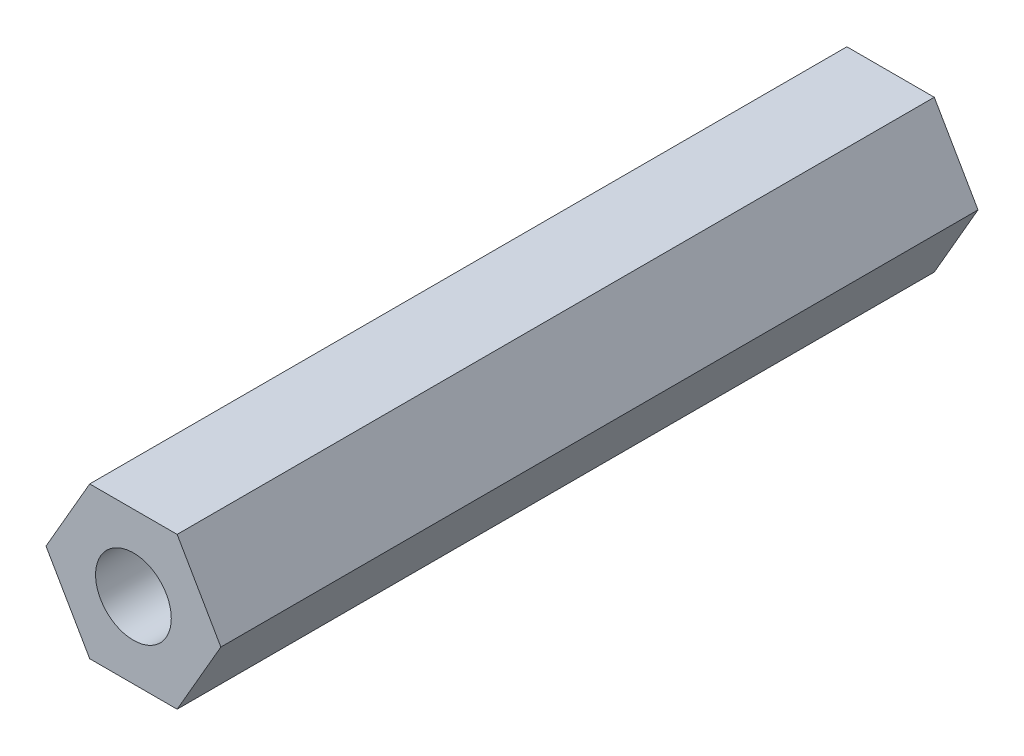
ISO-10303-21;
HEADER;
FILE_DESCRIPTION(('STEP AP214'),'2;1');
FILE_NAME('part.step','',(''),(''),'','','');
FILE_SCHEMA(('AUTOMOTIVE_DESIGN { 1 0 10303 214 1 1 1 1 }'));
ENDSEC;
DATA;
#1=APPLICATION_CONTEXT('core data for automotive mechanical design processes');
#2=APPLICATION_PROTOCOL_DEFINITION('international standard','automotive_design',2000,#1);
#3=PRODUCT_CONTEXT('',#1,'mechanical');
#4=PRODUCT('Part','Part','',(#3));
#5=PRODUCT_RELATED_PRODUCT_CATEGORY('part','',(#4));
#6=PRODUCT_DEFINITION_FORMATION('','',#4);
#7=PRODUCT_DEFINITION_CONTEXT('part definition',#1,'design');
#8=PRODUCT_DEFINITION('design','',#6,#7);
#9=PRODUCT_DEFINITION_SHAPE('','',#8);
#10=(LENGTH_UNIT() NAMED_UNIT(*) SI_UNIT(.MILLI.,.METRE.));
#11=(NAMED_UNIT(*) PLANE_ANGLE_UNIT() SI_UNIT($,.RADIAN.));
#12=(NAMED_UNIT(*) SI_UNIT($,.STERADIAN.) SOLID_ANGLE_UNIT());
#13=UNCERTAINTY_MEASURE_WITH_UNIT(LENGTH_MEASURE(1.E-05),#10,'distance_accuracy_value','');
#14=(GEOMETRIC_REPRESENTATION_CONTEXT(3) GLOBAL_UNCERTAINTY_ASSIGNED_CONTEXT((#13)) GLOBAL_UNIT_ASSIGNED_CONTEXT((#10,
#11,#12)) REPRESENTATION_CONTEXT('',''));
#15=CARTESIAN_POINT('',(0.,0.,0.));
#16=DIRECTION('',(0.,0.,1.));
#17=DIRECTION('',(1.,0.,0.));
#18=AXIS2_PLACEMENT_3D('',#15,#16,#17);
#19=CARTESIAN_POINT('',(2.88675134594813,0.,25.));
#20=DIRECTION('',(-0.866025403784439,-0.5,0.));
#21=DIRECTION('',(0.5,-0.866025403784439,0.));
#22=AXIS2_PLACEMENT_3D('',#19,#20,#21);
#23=PLANE('',#22);
#24=DIRECTION('',(-0.5,0.866025403784439,0.));
#25=VECTOR('',#24,1.);
#26=CARTESIAN_POINT('',(2.88675134594813,0.,0.));
#27=LINE('',#26,#25);
#28=CARTESIAN_POINT('',(2.88675134594813,0.,0.));
#29=VERTEX_POINT('',#28);
#30=CARTESIAN_POINT('',(1.44337567297406,2.5,0.));
#31=VERTEX_POINT('',#30);
#32=EDGE_CURVE('E121',#29,#31,#27,.T.);
#33=ORIENTED_EDGE('',*,*,#32,.T.);
#34=DIRECTION('',(0.,0.,-1.));
#35=VECTOR('',#34,1.);
#36=CARTESIAN_POINT('',(1.44337567297406,2.5,25.));
#37=LINE('',#36,#35);
#38=CARTESIAN_POINT('',(1.44337567297406,2.5,25.));
#39=VERTEX_POINT('',#38);
#40=EDGE_CURVE('E11',#39,#31,#37,.T.);
#41=ORIENTED_EDGE('',*,*,#40,.F.);
#42=DIRECTION('',(-0.5,0.866025403784439,0.));
#43=VECTOR('',#42,1.);
#44=CARTESIAN_POINT('',(2.88675134594813,0.,25.));
#45=LINE('',#44,#43);
#46=CARTESIAN_POINT('',(2.88675134594813,0.,25.));
#47=VERTEX_POINT('',#46);
#48=EDGE_CURVE('E132',#47,#39,#45,.T.);
#49=ORIENTED_EDGE('',*,*,#48,.F.);
#50=DIRECTION('',(0.,0.,-1.));
#51=VECTOR('',#50,1.);
#52=CARTESIAN_POINT('',(2.88675134594813,0.,25.));
#53=LINE('',#52,#51);
#54=EDGE_CURVE('E117',#47,#29,#53,.T.);
#55=ORIENTED_EDGE('',*,*,#54,.T.);
#56=EDGE_LOOP('',(#33,#41,#49,#55));
#57=FACE_BOUND('',#56,.T.);
#58=ADVANCED_FACE('F37',(#57),#23,.F.);
#59=CARTESIAN_POINT('',(1.44337567297406,2.5,25.));
#60=DIRECTION('',(0.,-1.,0.));
#61=DIRECTION('',(0.,0.,-1.));
#62=AXIS2_PLACEMENT_3D('',#59,#60,#61);
#63=PLANE('',#62);
#64=DIRECTION('',(-1.,0.,0.));
#65=VECTOR('',#64,1.);
#66=CARTESIAN_POINT('',(1.44337567297406,2.5,0.));
#67=LINE('',#66,#65);
#68=CARTESIAN_POINT('',(-1.44337567297406,2.5,0.));
#69=VERTEX_POINT('',#68);
#70=EDGE_CURVE('E124',#31,#69,#67,.T.);
#71=ORIENTED_EDGE('',*,*,#70,.T.);
#72=DIRECTION('',(0.,0.,-1.));
#73=VECTOR('',#72,1.);
#74=CARTESIAN_POINT('',(-1.44337567297406,2.5,25.));
#75=LINE('',#74,#73);
#76=CARTESIAN_POINT('',(-1.44337567297406,2.5,25.));
#77=VERTEX_POINT('',#76);
#78=EDGE_CURVE('E45',#77,#69,#75,.T.);
#79=ORIENTED_EDGE('',*,*,#78,.F.);
#80=DIRECTION('',(-1.,0.,0.));
#81=VECTOR('',#80,1.);
#82=CARTESIAN_POINT('',(1.44337567297406,2.5,25.));
#83=LINE('',#82,#81);
#84=EDGE_CURVE('E90',#39,#77,#83,.T.);
#85=ORIENTED_EDGE('',*,*,#84,.F.);
#86=ORIENTED_EDGE('',*,*,#40,.T.);
#87=EDGE_LOOP('',(#71,#79,#85,#86));
#88=FACE_BOUND('',#87,.T.);
#89=ADVANCED_FACE('F157',(#88),#63,.F.);
#90=CARTESIAN_POINT('',(-1.44337567297406,2.5,25.));
#91=DIRECTION('',(0.866025403784439,-0.499999999999999,0.));
#92=DIRECTION('',(0.499999999999999,0.866025403784439,0.));
#93=AXIS2_PLACEMENT_3D('',#90,#91,#92);
#94=PLANE('',#93);
#95=DIRECTION('',(-0.499999999999999,-0.866025403784439,0.));
#96=VECTOR('',#95,1.);
#97=CARTESIAN_POINT('',(-1.44337567297406,2.5,0.));
#98=LINE('',#97,#96);
#99=CARTESIAN_POINT('',(-2.88675134594813,0.,0.));
#100=VERTEX_POINT('',#99);
#101=EDGE_CURVE('E127',#69,#100,#98,.T.);
#102=ORIENTED_EDGE('',*,*,#101,.T.);
#103=DIRECTION('',(0.,0.,-1.));
#104=VECTOR('',#103,1.);
#105=CARTESIAN_POINT('',(-2.88675134594813,0.,25.));
#106=LINE('',#105,#104);
#107=CARTESIAN_POINT('',(-2.88675134594813,0.,25.));
#108=VERTEX_POINT('',#107);
#109=EDGE_CURVE('E112',#108,#100,#106,.T.);
#110=ORIENTED_EDGE('',*,*,#109,.F.);
#111=DIRECTION('',(-0.499999999999999,-0.866025403784439,0.));
#112=VECTOR('',#111,1.);
#113=CARTESIAN_POINT('',(-1.44337567297406,2.5,25.));
#114=LINE('',#113,#112);
#115=EDGE_CURVE('E103',#77,#108,#114,.T.);
#116=ORIENTED_EDGE('',*,*,#115,.F.);
#117=ORIENTED_EDGE('',*,*,#78,.T.);
#118=EDGE_LOOP('',(#102,#110,#116,#117));
#119=FACE_BOUND('',#118,.T.);
#120=ADVANCED_FACE('F138',(#119),#94,.F.);
#121=CARTESIAN_POINT('',(-2.88675134594813,0.,25.));
#122=DIRECTION('',(0.866025403784438,0.5,0.));
#123=DIRECTION('',(-0.5,0.866025403784439,0.));
#124=AXIS2_PLACEMENT_3D('',#121,#122,#123);
#125=PLANE('',#124);
#126=DIRECTION('',(0.5,-0.866025403784438,0.));
#127=VECTOR('',#126,1.);
#128=CARTESIAN_POINT('',(-2.88675134594813,0.,0.));
#129=LINE('',#128,#127);
#130=CARTESIAN_POINT('',(-1.44337567297406,-2.5,0.));
#131=VERTEX_POINT('',#130);
#132=EDGE_CURVE('E111',#100,#131,#129,.T.);
#133=ORIENTED_EDGE('',*,*,#132,.T.);
#134=DIRECTION('',(0.,0.,-1.));
#135=VECTOR('',#134,1.);
#136=CARTESIAN_POINT('',(-1.44337567297406,-2.5,25.));
#137=LINE('',#136,#135);
#138=CARTESIAN_POINT('',(-1.44337567297406,-2.5,25.));
#139=VERTEX_POINT('',#138);
#140=EDGE_CURVE('E108',#139,#131,#137,.T.);
#141=ORIENTED_EDGE('',*,*,#140,.F.);
#142=DIRECTION('',(0.5,-0.866025403784438,0.));
#143=VECTOR('',#142,1.);
#144=CARTESIAN_POINT('',(-2.88675134594813,0.,25.));
#145=LINE('',#144,#143);
#146=EDGE_CURVE('E97',#108,#139,#145,.T.);
#147=ORIENTED_EDGE('',*,*,#146,.F.);
#148=ORIENTED_EDGE('',*,*,#109,.T.);
#149=EDGE_LOOP('',(#133,#141,#147,#148));
#150=FACE_BOUND('',#149,.T.);
#151=ADVANCED_FACE('F109',(#150),#125,.F.);
#152=CARTESIAN_POINT('',(-1.44337567297406,-2.5,25.));
#153=DIRECTION('',(0.,1.,0.));
#154=DIRECTION('',(-1.,0.,0.));
#155=AXIS2_PLACEMENT_3D('',#152,#153,#154);
#156=PLANE('',#155);
#157=DIRECTION('',(1.,0.,0.));
#158=VECTOR('',#157,1.);
#159=CARTESIAN_POINT('',(-1.44337567297406,-2.5,0.));
#160=LINE('',#159,#158);
#161=CARTESIAN_POINT('',(1.44337567297407,-2.5,0.));
#162=VERTEX_POINT('',#161);
#163=EDGE_CURVE('E76',#131,#162,#160,.T.);
#164=ORIENTED_EDGE('',*,*,#163,.T.);
#165=DIRECTION('',(0.,0.,-1.));
#166=VECTOR('',#165,1.);
#167=CARTESIAN_POINT('',(1.44337567297407,-2.5,25.));
#168=LINE('',#167,#166);
#169=CARTESIAN_POINT('',(1.44337567297407,-2.5,25.));
#170=VERTEX_POINT('',#169);
#171=EDGE_CURVE('E113',#170,#162,#168,.T.);
#172=ORIENTED_EDGE('',*,*,#171,.F.);
#173=DIRECTION('',(1.,0.,0.));
#174=VECTOR('',#173,1.);
#175=CARTESIAN_POINT('',(-1.44337567297406,-2.5,25.));
#176=LINE('',#175,#174);
#177=EDGE_CURVE('E101',#139,#170,#176,.T.);
#178=ORIENTED_EDGE('',*,*,#177,.F.);
#179=ORIENTED_EDGE('',*,*,#140,.T.);
#180=EDGE_LOOP('',(#164,#172,#178,#179));
#181=FACE_BOUND('',#180,.T.);
#182=ADVANCED_FACE('F115',(#181),#156,.F.);
#183=CARTESIAN_POINT('',(1.44337567297407,-2.5,25.));
#184=DIRECTION('',(-0.866025403784439,0.5,0.));
#185=DIRECTION('',(-0.5,-0.866025403784439,0.));
#186=AXIS2_PLACEMENT_3D('',#183,#184,#185);
#187=PLANE('',#186);
#188=DIRECTION('',(0.5,0.866025403784439,0.));
#189=VECTOR('',#188,1.);
#190=CARTESIAN_POINT('',(1.44337567297407,-2.5,0.));
#191=LINE('',#190,#189);
#192=EDGE_CURVE('E82',#162,#29,#191,.T.);
#193=ORIENTED_EDGE('',*,*,#192,.T.);
#194=ORIENTED_EDGE('',*,*,#54,.F.);
#195=DIRECTION('',(0.5,0.866025403784439,0.));
#196=VECTOR('',#195,1.);
#197=CARTESIAN_POINT('',(1.44337567297407,-2.5,25.));
#198=LINE('',#197,#196);
#199=EDGE_CURVE('E53',#170,#47,#198,.T.);
#200=ORIENTED_EDGE('',*,*,#199,.F.);
#201=ORIENTED_EDGE('',*,*,#171,.T.);
#202=EDGE_LOOP('',(#193,#194,#200,#201));
#203=FACE_BOUND('',#202,.T.);
#204=ADVANCED_FACE('F145',(#203),#187,.F.);
#205=CARTESIAN_POINT('',(0.,0.,25.));
#206=DIRECTION('',(0.,0.,1.));
#207=DIRECTION('',(1.,0.,0.));
#208=AXIS2_PLACEMENT_3D('',#205,#206,#207);
#209=PLANE('',#208);
#210=CARTESIAN_POINT('',(0.,0.,25.));
#211=DIRECTION('',(0.,0.,1.));
#212=DIRECTION('',(1.,0.,0.));
#213=AXIS2_PLACEMENT_3D('',#210,#211,#212);
#214=CIRCLE('',#213,1.25);
#215=CARTESIAN_POINT('',(1.25,0.,25.));
#216=VERTEX_POINT('',#215);
#217=EDGE_CURVE('E214',#216,#216,#214,.T.);
#218=ORIENTED_EDGE('',*,*,#217,.F.);
#219=EDGE_LOOP('',(#218));
#220=FACE_BOUND('',#219,.T.);
#221=ORIENTED_EDGE('',*,*,#48,.T.);
#222=ORIENTED_EDGE('',*,*,#84,.T.);
#223=ORIENTED_EDGE('',*,*,#115,.T.);
#224=ORIENTED_EDGE('',*,*,#146,.T.);
#225=ORIENTED_EDGE('',*,*,#177,.T.);
#226=ORIENTED_EDGE('',*,*,#199,.T.);
#227=EDGE_LOOP('',(#221,#222,#223,#224,#225,#226));
#228=FACE_BOUND('',#227,.T.);
#229=ADVANCED_FACE('F99',(#220,#228),#209,.T.);
#230=CARTESIAN_POINT('',(0.,0.,0.));
#231=DIRECTION('',(0.,0.,1.));
#232=DIRECTION('',(1.,0.,0.));
#233=AXIS2_PLACEMENT_3D('',#230,#231,#232);
#234=PLANE('',#233);
#235=CARTESIAN_POINT('',(0.,0.,0.));
#236=DIRECTION('',(0.,0.,1.));
#237=DIRECTION('',(1.,0.,0.));
#238=AXIS2_PLACEMENT_3D('',#235,#236,#237);
#239=CIRCLE('',#238,1.24999999999999);
#240=CARTESIAN_POINT('',(1.24999999999999,0.,0.));
#241=VERTEX_POINT('',#240);
#242=EDGE_CURVE('E125',#241,#241,#239,.T.);
#243=ORIENTED_EDGE('',*,*,#242,.T.);
#244=EDGE_LOOP('',(#243));
#245=FACE_BOUND('',#244,.T.);
#246=ORIENTED_EDGE('',*,*,#32,.F.);
#247=ORIENTED_EDGE('',*,*,#192,.F.);
#248=ORIENTED_EDGE('',*,*,#163,.F.);
#249=ORIENTED_EDGE('',*,*,#132,.F.);
#250=ORIENTED_EDGE('',*,*,#101,.F.);
#251=ORIENTED_EDGE('',*,*,#70,.F.);
#252=EDGE_LOOP('',(#246,#247,#248,#249,#250,#251));
#253=FACE_BOUND('',#252,.T.);
#254=ADVANCED_FACE('F141',(#245,#253),#234,.F.);
#255=CARTESIAN_POINT('',(0.,0.,25.));
#256=DIRECTION('',(0.,0.,1.));
#257=DIRECTION('',(1.,0.,0.));
#258=AXIS2_PLACEMENT_3D('',#255,#256,#257);
#259=CYLINDRICAL_SURFACE('',#258,1.25);
#260=ORIENTED_EDGE('',*,*,#242,.F.);
#261=EDGE_LOOP('',(#260));
#262=FACE_BOUND('',#261,.T.);
#263=ORIENTED_EDGE('',*,*,#217,.T.);
#264=EDGE_LOOP('',(#263));
#265=FACE_BOUND('',#264,.T.);
#266=ADVANCED_FACE('F194',(#262,#265),#259,.F.);
#267=CLOSED_SHELL('',(#58,#89,#120,#151,#182,#204,#229,#254,#266));
#268=MANIFOLD_SOLID_BREP('B2',#267);
#269=ADVANCED_BREP_SHAPE_REPRESENTATION('',(#18,#268),#14);
#270=SHAPE_DEFINITION_REPRESENTATION(#9,#269);
ENDSEC;
END-ISO-10303-21;
